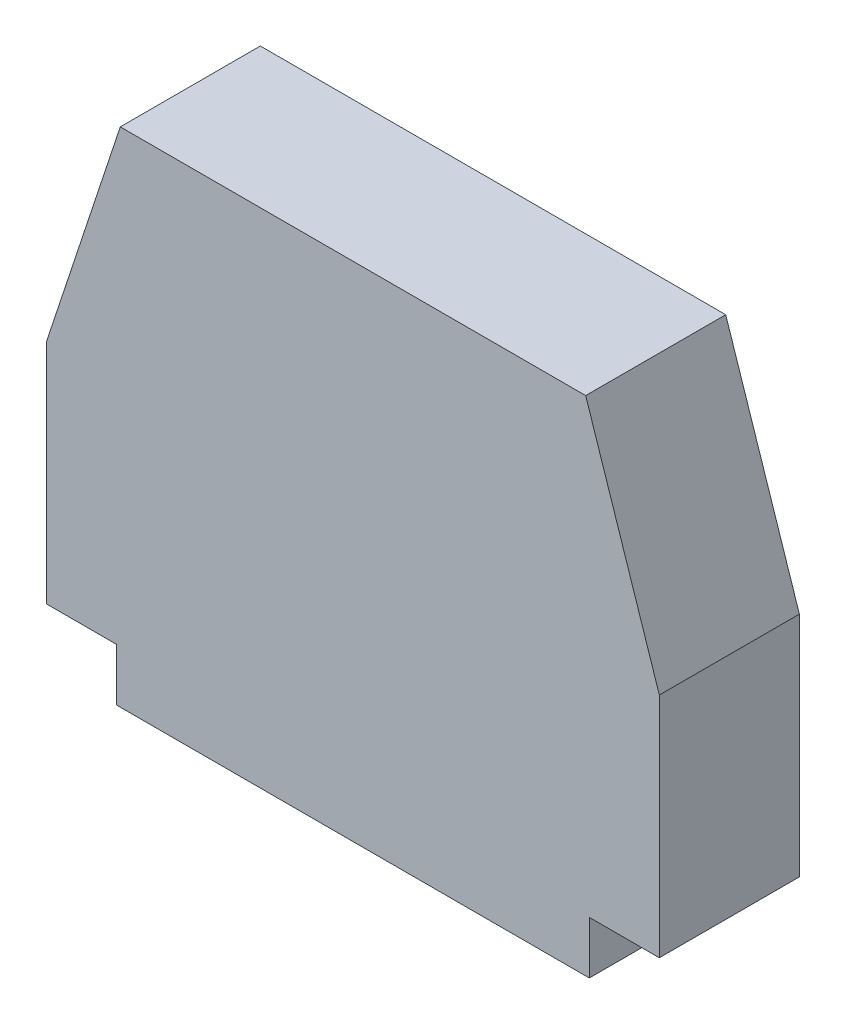
ISO-10303-21;
HEADER;
FILE_DESCRIPTION(('STEP AP214'),'2;1');
FILE_NAME('part.step','',(''),(''),'','','');
FILE_SCHEMA(('AUTOMOTIVE_DESIGN { 1 0 10303 214 1 1 1 1 }'));
ENDSEC;
DATA;
#1=APPLICATION_CONTEXT('core data for automotive mechanical design processes');
#2=APPLICATION_PROTOCOL_DEFINITION('international standard','automotive_design',2000,#1);
#3=PRODUCT_CONTEXT('',#1,'mechanical');
#4=PRODUCT('Part','Part','',(#3));
#5=PRODUCT_RELATED_PRODUCT_CATEGORY('part','',(#4));
#6=PRODUCT_DEFINITION_FORMATION('','',#4);
#7=PRODUCT_DEFINITION_CONTEXT('part definition',#1,'design');
#8=PRODUCT_DEFINITION('design','',#6,#7);
#9=PRODUCT_DEFINITION_SHAPE('','',#8);
#10=(LENGTH_UNIT() NAMED_UNIT(*) SI_UNIT(.MILLI.,.METRE.));
#11=(NAMED_UNIT(*) PLANE_ANGLE_UNIT() SI_UNIT($,.RADIAN.));
#12=(NAMED_UNIT(*) SI_UNIT($,.STERADIAN.) SOLID_ANGLE_UNIT());
#13=UNCERTAINTY_MEASURE_WITH_UNIT(LENGTH_MEASURE(1.E-05),#10,'distance_accuracy_value','');
#14=(GEOMETRIC_REPRESENTATION_CONTEXT(3) GLOBAL_UNCERTAINTY_ASSIGNED_CONTEXT((#13)) GLOBAL_UNIT_ASSIGNED_CONTEXT((#10,
#11,#12)) REPRESENTATION_CONTEXT('',''));
#15=CARTESIAN_POINT('',(0.,0.,0.));
#16=DIRECTION('',(0.,0.,1.));
#17=DIRECTION('',(1.,0.,0.));
#18=AXIS2_PLACEMENT_3D('',#15,#16,#17);
#19=CARTESIAN_POINT('',(-13.2924290350548,28.7088246133584,8.));
#20=DIRECTION('',(0.,-1.,0.));
#21=DIRECTION('',(0.,0.,-1.));
#22=AXIS2_PLACEMENT_3D('',#19,#20,#21);
#23=PLANE('',#22);
#24=DIRECTION('',(-1.,0.,0.));
#25=VECTOR('',#24,1.);
#26=CARTESIAN_POINT('',(-13.2924290350548,28.7088246133584,0.));
#27=LINE('',#26,#25);
#28=CARTESIAN_POINT('',(13.2924290350548,28.7088246133584,0.));
#29=VERTEX_POINT('',#28);
#30=CARTESIAN_POINT('',(-13.2924290350548,28.7088246133584,0.));
#31=VERTEX_POINT('',#30);
#32=EDGE_CURVE('E142',#29,#31,#27,.T.);
#33=ORIENTED_EDGE('',*,*,#32,.T.);
#34=DIRECTION('',(0.,0.,-1.));
#35=VECTOR('',#34,1.);
#36=CARTESIAN_POINT('',(-13.2924290350548,28.7088246133584,8.));
#37=LINE('',#36,#35);
#38=CARTESIAN_POINT('',(-13.2924290350548,28.7088246133584,8.));
#39=VERTEX_POINT('',#38);
#40=EDGE_CURVE('E11',#39,#31,#37,.T.);
#41=ORIENTED_EDGE('',*,*,#40,.F.);
#42=DIRECTION('',(-1.,0.,0.));
#43=VECTOR('',#42,1.);
#44=CARTESIAN_POINT('',(-13.2924290350548,28.7088246133584,8.));
#45=LINE('',#44,#43);
#46=CARTESIAN_POINT('',(13.2924290350548,28.7088246133584,8.));
#47=VERTEX_POINT('',#46);
#48=EDGE_CURVE('E160',#47,#39,#45,.T.);
#49=ORIENTED_EDGE('',*,*,#48,.F.);
#50=DIRECTION('',(0.,0.,-1.));
#51=VECTOR('',#50,1.);
#52=CARTESIAN_POINT('',(13.2924290350548,28.7088246133584,8.));
#53=LINE('',#52,#51);
#54=EDGE_CURVE('E138',#47,#29,#53,.T.);
#55=ORIENTED_EDGE('',*,*,#54,.T.);
#56=EDGE_LOOP('',(#33,#41,#49,#55));
#57=FACE_BOUND('',#56,.T.);
#58=ADVANCED_FACE('F34',(#57),#23,.F.);
#59=CARTESIAN_POINT('',(-17.5,16.,8.));
#60=DIRECTION('',(0.949324573288384,-0.314297398256535,0.));
#61=DIRECTION('',(0.314297398256535,0.949324573288384,0.));
#62=AXIS2_PLACEMENT_3D('',#59,#60,#61);
#63=PLANE('',#62);
#64=DIRECTION('',(-0.314297398256535,-0.949324573288384,0.));
#65=VECTOR('',#64,1.);
#66=CARTESIAN_POINT('',(-17.5,16.,0.));
#67=LINE('',#66,#65);
#68=CARTESIAN_POINT('',(-17.5,16.,0.));
#69=VERTEX_POINT('',#68);
#70=EDGE_CURVE('E145',#31,#69,#67,.T.);
#71=ORIENTED_EDGE('',*,*,#70,.T.);
#72=DIRECTION('',(0.,0.,-1.));
#73=VECTOR('',#72,1.);
#74=CARTESIAN_POINT('',(-17.5,16.,8.));
#75=LINE('',#74,#73);
#76=CARTESIAN_POINT('',(-17.5,16.,8.));
#77=VERTEX_POINT('',#76);
#78=EDGE_CURVE('E42',#77,#69,#75,.T.);
#79=ORIENTED_EDGE('',*,*,#78,.F.);
#80=DIRECTION('',(-0.314297398256535,-0.949324573288384,0.));
#81=VECTOR('',#80,1.);
#82=CARTESIAN_POINT('',(-17.5,16.,8.));
#83=LINE('',#82,#81);
#84=EDGE_CURVE('E99',#39,#77,#83,.T.);
#85=ORIENTED_EDGE('',*,*,#84,.F.);
#86=ORIENTED_EDGE('',*,*,#40,.T.);
#87=EDGE_LOOP('',(#71,#79,#85,#86));
#88=FACE_BOUND('',#87,.T.);
#89=ADVANCED_FACE('F209',(#88),#63,.F.);
#90=CARTESIAN_POINT('',(-17.5,3.,8.));
#91=DIRECTION('',(1.,0.,0.));
#92=DIRECTION('',(0.,0.,-1.));
#93=AXIS2_PLACEMENT_3D('',#90,#91,#92);
#94=PLANE('',#93);
#95=DIRECTION('',(0.,-1.,0.));
#96=VECTOR('',#95,1.);
#97=CARTESIAN_POINT('',(-17.5,3.,0.));
#98=LINE('',#97,#96);
#99=CARTESIAN_POINT('',(-17.5,3.,0.));
#100=VERTEX_POINT('',#99);
#101=EDGE_CURVE('E147',#69,#100,#98,.T.);
#102=ORIENTED_EDGE('',*,*,#101,.T.);
#103=DIRECTION('',(0.,0.,-1.));
#104=VECTOR('',#103,1.);
#105=CARTESIAN_POINT('',(-17.5,3.,8.));
#106=LINE('',#105,#104);
#107=CARTESIAN_POINT('',(-17.5,3.,8.));
#108=VERTEX_POINT('',#107);
#109=EDGE_CURVE('E173',#108,#100,#106,.T.);
#110=ORIENTED_EDGE('',*,*,#109,.F.);
#111=DIRECTION('',(0.,-1.,0.));
#112=VECTOR('',#111,1.);
#113=CARTESIAN_POINT('',(-17.5,3.,8.));
#114=LINE('',#113,#112);
#115=EDGE_CURVE('E181',#77,#108,#114,.T.);
#116=ORIENTED_EDGE('',*,*,#115,.F.);
#117=ORIENTED_EDGE('',*,*,#78,.T.);
#118=EDGE_LOOP('',(#102,#110,#116,#117));
#119=FACE_BOUND('',#118,.T.);
#120=ADVANCED_FACE('F179',(#119),#94,.F.);
#121=CARTESIAN_POINT('',(-17.5,3.,8.));
#122=DIRECTION('',(0.,1.,0.));
#123=DIRECTION('',(0.,0.,1.));
#124=AXIS2_PLACEMENT_3D('',#121,#122,#123);
#125=PLANE('',#124);
#126=DIRECTION('',(1.,0.,0.));
#127=VECTOR('',#126,1.);
#128=CARTESIAN_POINT('',(-17.5,3.,0.));
#129=LINE('',#128,#127);
#130=CARTESIAN_POINT('',(-13.5,3.,0.));
#131=VERTEX_POINT('',#130);
#132=EDGE_CURVE('E149',#100,#131,#129,.T.);
#133=ORIENTED_EDGE('',*,*,#132,.T.);
#134=DIRECTION('',(0.,0.,-1.));
#135=VECTOR('',#134,1.);
#136=CARTESIAN_POINT('',(-13.5,3.,8.));
#137=LINE('',#136,#135);
#138=CARTESIAN_POINT('',(-13.5,3.,8.));
#139=VERTEX_POINT('',#138);
#140=EDGE_CURVE('E170',#139,#131,#137,.T.);
#141=ORIENTED_EDGE('',*,*,#140,.F.);
#142=DIRECTION('',(1.,0.,0.));
#143=VECTOR('',#142,1.);
#144=CARTESIAN_POINT('',(-17.5,3.,8.));
#145=LINE('',#144,#143);
#146=EDGE_CURVE('E199',#108,#139,#145,.T.);
#147=ORIENTED_EDGE('',*,*,#146,.F.);
#148=ORIENTED_EDGE('',*,*,#109,.T.);
#149=EDGE_LOOP('',(#133,#141,#147,#148));
#150=FACE_BOUND('',#149,.T.);
#151=ADVANCED_FACE('F190',(#150),#125,.F.);
#152=CARTESIAN_POINT('',(-13.5,3.,8.));
#153=DIRECTION('',(1.,0.,0.));
#154=DIRECTION('',(0.,0.,-1.));
#155=AXIS2_PLACEMENT_3D('',#152,#153,#154);
#156=PLANE('',#155);
#157=DIRECTION('',(0.,-1.,0.));
#158=VECTOR('',#157,1.);
#159=CARTESIAN_POINT('',(-13.5,3.,0.));
#160=LINE('',#159,#158);
#161=CARTESIAN_POINT('',(-13.5,0.,0.));
#162=VERTEX_POINT('',#161);
#163=EDGE_CURVE('E151',#131,#162,#160,.T.);
#164=ORIENTED_EDGE('',*,*,#163,.T.);
#165=DIRECTION('',(0.,0.,-1.));
#166=VECTOR('',#165,1.);
#167=CARTESIAN_POINT('',(-13.5,0.,8.));
#168=LINE('',#167,#166);
#169=CARTESIAN_POINT('',(-13.5,0.,8.));
#170=VERTEX_POINT('',#169);
#171=EDGE_CURVE('E167',#170,#162,#168,.T.);
#172=ORIENTED_EDGE('',*,*,#171,.F.);
#173=DIRECTION('',(0.,-1.,0.));
#174=VECTOR('',#173,1.);
#175=CARTESIAN_POINT('',(-13.5,3.,8.));
#176=LINE('',#175,#174);
#177=EDGE_CURVE('E196',#139,#170,#176,.T.);
#178=ORIENTED_EDGE('',*,*,#177,.F.);
#179=ORIENTED_EDGE('',*,*,#140,.T.);
#180=EDGE_LOOP('',(#164,#172,#178,#179));
#181=FACE_BOUND('',#180,.T.);
#182=ADVANCED_FACE('F194',(#181),#156,.F.);
#183=CARTESIAN_POINT('',(-13.5,0.,8.));
#184=DIRECTION('',(0.,1.,0.));
#185=DIRECTION('',(0.,0.,1.));
#186=AXIS2_PLACEMENT_3D('',#183,#184,#185);
#187=PLANE('',#186);
#188=DIRECTION('',(1.,0.,0.));
#189=VECTOR('',#188,1.);
#190=CARTESIAN_POINT('',(-13.5,0.,0.));
#191=LINE('',#190,#189);
#192=CARTESIAN_POINT('',(13.5,0.,0.));
#193=VERTEX_POINT('',#192);
#194=EDGE_CURVE('E153',#162,#193,#191,.T.);
#195=ORIENTED_EDGE('',*,*,#194,.T.);
#196=DIRECTION('',(0.,0.,-1.));
#197=VECTOR('',#196,1.);
#198=CARTESIAN_POINT('',(13.5,0.,8.));
#199=LINE('',#198,#197);
#200=CARTESIAN_POINT('',(13.5,0.,8.));
#201=VERTEX_POINT('',#200);
#202=EDGE_CURVE('E164',#201,#193,#199,.T.);
#203=ORIENTED_EDGE('',*,*,#202,.F.);
#204=DIRECTION('',(1.,0.,0.));
#205=VECTOR('',#204,1.);
#206=CARTESIAN_POINT('',(-13.5,0.,8.));
#207=LINE('',#206,#205);
#208=EDGE_CURVE('E198',#170,#201,#207,.T.);
#209=ORIENTED_EDGE('',*,*,#208,.F.);
#210=ORIENTED_EDGE('',*,*,#171,.T.);
#211=EDGE_LOOP('',(#195,#203,#209,#210));
#212=FACE_BOUND('',#211,.T.);
#213=ADVANCED_FACE('F221',(#212),#187,.F.);
#214=CARTESIAN_POINT('',(13.5,3.,8.));
#215=DIRECTION('',(-1.,0.,0.));
#216=DIRECTION('',(0.,0.,1.));
#217=AXIS2_PLACEMENT_3D('',#214,#215,#216);
#218=PLANE('',#217);
#219=DIRECTION('',(0.,1.,0.));
#220=VECTOR('',#219,1.);
#221=CARTESIAN_POINT('',(13.5,3.,0.));
#222=LINE('',#221,#220);
#223=CARTESIAN_POINT('',(13.5,3.,0.));
#224=VERTEX_POINT('',#223);
#225=EDGE_CURVE('E155',#193,#224,#222,.T.);
#226=ORIENTED_EDGE('',*,*,#225,.T.);
#227=DIRECTION('',(0.,0.,-1.));
#228=VECTOR('',#227,1.);
#229=CARTESIAN_POINT('',(13.5,3.,8.));
#230=LINE('',#229,#228);
#231=CARTESIAN_POINT('',(13.5,3.,8.));
#232=VERTEX_POINT('',#231);
#233=EDGE_CURVE('E133',#232,#224,#230,.T.);
#234=ORIENTED_EDGE('',*,*,#233,.F.);
#235=DIRECTION('',(0.,1.,0.));
#236=VECTOR('',#235,1.);
#237=CARTESIAN_POINT('',(13.5,3.,8.));
#238=LINE('',#237,#236);
#239=EDGE_CURVE('E124',#201,#232,#238,.T.);
#240=ORIENTED_EDGE('',*,*,#239,.F.);
#241=ORIENTED_EDGE('',*,*,#202,.T.);
#242=EDGE_LOOP('',(#226,#234,#240,#241));
#243=FACE_BOUND('',#242,.T.);
#244=ADVANCED_FACE('F224',(#243),#218,.F.);
#245=CARTESIAN_POINT('',(17.5,3.,8.));
#246=DIRECTION('',(0.,1.,0.));
#247=DIRECTION('',(0.,0.,1.));
#248=AXIS2_PLACEMENT_3D('',#245,#246,#247);
#249=PLANE('',#248);
#250=DIRECTION('',(1.,0.,0.));
#251=VECTOR('',#250,1.);
#252=CARTESIAN_POINT('',(17.5,3.,0.));
#253=LINE('',#252,#251);
#254=CARTESIAN_POINT('',(17.5,3.,0.));
#255=VERTEX_POINT('',#254);
#256=EDGE_CURVE('E132',#224,#255,#253,.T.);
#257=ORIENTED_EDGE('',*,*,#256,.T.);
#258=DIRECTION('',(0.,0.,-1.));
#259=VECTOR('',#258,1.);
#260=CARTESIAN_POINT('',(17.5,3.,8.));
#261=LINE('',#260,#259);
#262=CARTESIAN_POINT('',(17.5,3.,8.));
#263=VERTEX_POINT('',#262);
#264=EDGE_CURVE('E129',#263,#255,#261,.T.);
#265=ORIENTED_EDGE('',*,*,#264,.F.);
#266=DIRECTION('',(1.,0.,0.));
#267=VECTOR('',#266,1.);
#268=CARTESIAN_POINT('',(17.5,3.,8.));
#269=LINE('',#268,#267);
#270=EDGE_CURVE('E118',#232,#263,#269,.T.);
#271=ORIENTED_EDGE('',*,*,#270,.F.);
#272=ORIENTED_EDGE('',*,*,#233,.T.);
#273=EDGE_LOOP('',(#257,#265,#271,#272));
#274=FACE_BOUND('',#273,.T.);
#275=ADVANCED_FACE('F130',(#274),#249,.F.);
#276=CARTESIAN_POINT('',(17.5,3.,8.));
#277=DIRECTION('',(-1.,0.,0.));
#278=DIRECTION('',(0.,0.,1.));
#279=AXIS2_PLACEMENT_3D('',#276,#277,#278);
#280=PLANE('',#279);
#281=DIRECTION('',(0.,1.,0.));
#282=VECTOR('',#281,1.);
#283=CARTESIAN_POINT('',(17.5,3.,0.));
#284=LINE('',#283,#282);
#285=CARTESIAN_POINT('',(17.5,16.,0.));
#286=VERTEX_POINT('',#285);
#287=EDGE_CURVE('E85',#255,#286,#284,.T.);
#288=ORIENTED_EDGE('',*,*,#287,.T.);
#289=DIRECTION('',(0.,0.,-1.));
#290=VECTOR('',#289,1.);
#291=CARTESIAN_POINT('',(17.5,16.,8.));
#292=LINE('',#291,#290);
#293=CARTESIAN_POINT('',(17.5,16.,8.));
#294=VERTEX_POINT('',#293);
#295=EDGE_CURVE('E134',#294,#286,#292,.T.);
#296=ORIENTED_EDGE('',*,*,#295,.F.);
#297=DIRECTION('',(0.,1.,0.));
#298=VECTOR('',#297,1.);
#299=CARTESIAN_POINT('',(17.5,3.,8.));
#300=LINE('',#299,#298);
#301=EDGE_CURVE('E122',#263,#294,#300,.T.);
#302=ORIENTED_EDGE('',*,*,#301,.F.);
#303=ORIENTED_EDGE('',*,*,#264,.T.);
#304=EDGE_LOOP('',(#288,#296,#302,#303));
#305=FACE_BOUND('',#304,.T.);
#306=ADVANCED_FACE('F136',(#305),#280,.F.);
#307=CARTESIAN_POINT('',(17.5,16.,8.));
#308=DIRECTION('',(-0.949324573288385,-0.314297398256534,0.));
#309=DIRECTION('',(0.314297398256534,-0.949324573288385,0.));
#310=AXIS2_PLACEMENT_3D('',#307,#308,#309);
#311=PLANE('',#310);
#312=DIRECTION('',(-0.314297398256534,0.949324573288385,0.));
#313=VECTOR('',#312,1.);
#314=CARTESIAN_POINT('',(17.5,16.,0.));
#315=LINE('',#314,#313);
#316=EDGE_CURVE('E91',#286,#29,#315,.T.);
#317=ORIENTED_EDGE('',*,*,#316,.T.);
#318=ORIENTED_EDGE('',*,*,#54,.F.);
#319=DIRECTION('',(-0.314297398256534,0.949324573288385,0.));
#320=VECTOR('',#319,1.);
#321=CARTESIAN_POINT('',(17.5,16.,8.));
#322=LINE('',#321,#320);
#323=EDGE_CURVE('E50',#294,#47,#322,.T.);
#324=ORIENTED_EDGE('',*,*,#323,.F.);
#325=ORIENTED_EDGE('',*,*,#295,.T.);
#326=EDGE_LOOP('',(#317,#318,#324,#325));
#327=FACE_BOUND('',#326,.T.);
#328=ADVANCED_FACE('F233',(#327),#311,.F.);
#329=CARTESIAN_POINT('',(0.,0.,8.));
#330=DIRECTION('',(0.,0.,1.));
#331=DIRECTION('',(1.,0.,0.));
#332=AXIS2_PLACEMENT_3D('',#329,#330,#331);
#333=PLANE('',#332);
#334=ORIENTED_EDGE('',*,*,#48,.T.);
#335=ORIENTED_EDGE('',*,*,#84,.T.);
#336=ORIENTED_EDGE('',*,*,#115,.T.);
#337=ORIENTED_EDGE('',*,*,#146,.T.);
#338=ORIENTED_EDGE('',*,*,#177,.T.);
#339=ORIENTED_EDGE('',*,*,#208,.T.);
#340=ORIENTED_EDGE('',*,*,#239,.T.);
#341=ORIENTED_EDGE('',*,*,#270,.T.);
#342=ORIENTED_EDGE('',*,*,#301,.T.);
#343=ORIENTED_EDGE('',*,*,#323,.T.);
#344=EDGE_LOOP('',(#334,#335,#336,#337,#338,#339,#340,#341,#342,#343));
#345=FACE_BOUND('',#344,.T.);
#346=ADVANCED_FACE('F120',(#345),#333,.T.);
#347=CARTESIAN_POINT('',(0.,0.,0.));
#348=DIRECTION('',(0.,0.,1.));
#349=DIRECTION('',(1.,0.,0.));
#350=AXIS2_PLACEMENT_3D('',#347,#348,#349);
#351=PLANE('',#350);
#352=ORIENTED_EDGE('',*,*,#32,.F.);
#353=ORIENTED_EDGE('',*,*,#316,.F.);
#354=ORIENTED_EDGE('',*,*,#287,.F.);
#355=ORIENTED_EDGE('',*,*,#256,.F.);
#356=ORIENTED_EDGE('',*,*,#225,.F.);
#357=ORIENTED_EDGE('',*,*,#194,.F.);
#358=ORIENTED_EDGE('',*,*,#163,.F.);
#359=ORIENTED_EDGE('',*,*,#132,.F.);
#360=ORIENTED_EDGE('',*,*,#101,.F.);
#361=ORIENTED_EDGE('',*,*,#70,.F.);
#362=EDGE_LOOP('',(#352,#353,#354,#355,#356,#357,#358,#359,#360,#361));
#363=FACE_BOUND('',#362,.T.);
#364=ADVANCED_FACE('F185',(#363),#351,.F.);
#365=CLOSED_SHELL('',(#58,#89,#120,#151,#182,#213,#244,#275,#306,#328,#346,#364));
#366=MANIFOLD_SOLID_BREP('B2',#365);
#367=ADVANCED_BREP_SHAPE_REPRESENTATION('',(#18,#366),#14);
#368=SHAPE_DEFINITION_REPRESENTATION(#9,#367);
ENDSEC;
END-ISO-10303-21;
